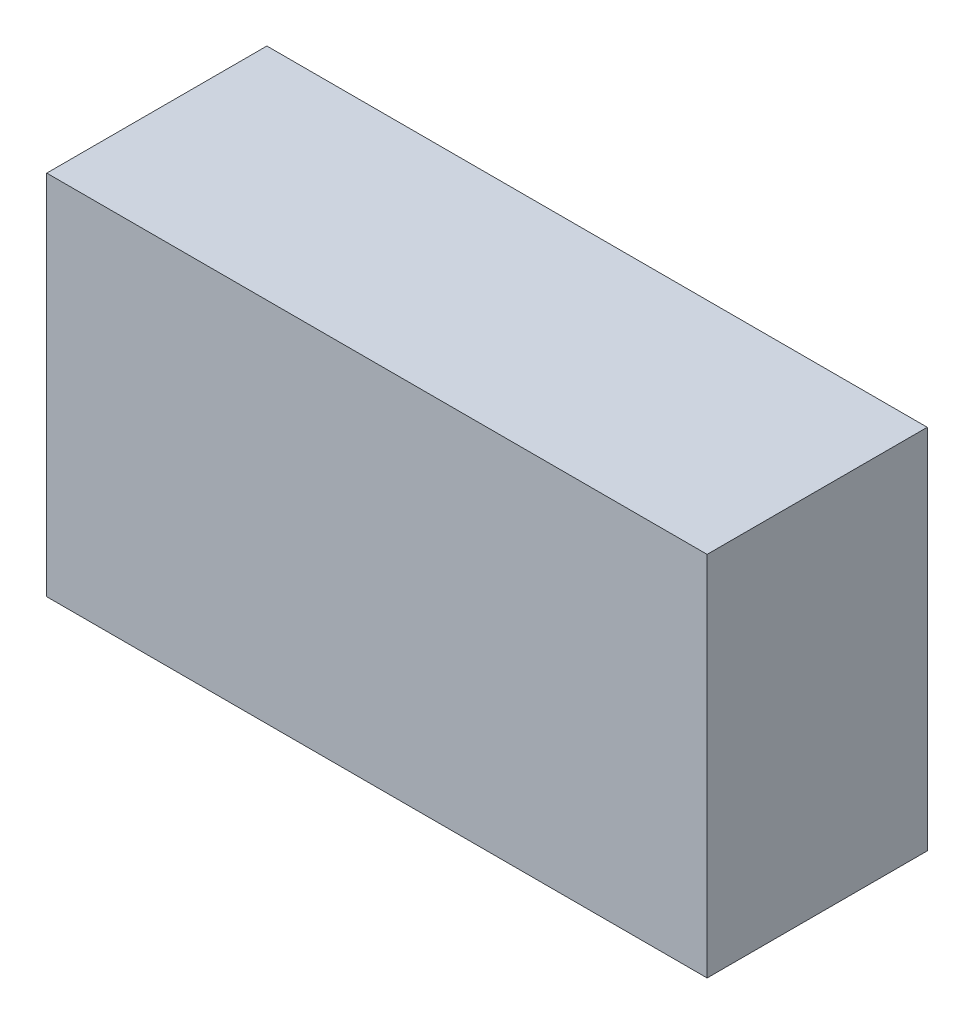
ISO-10303-21;
HEADER;
FILE_DESCRIPTION(('STEP AP214'),'2;1');
FILE_NAME('part.step','',(''),(''),'','','');
FILE_SCHEMA(('AUTOMOTIVE_DESIGN { 1 0 10303 214 1 1 1 1 }'));
ENDSEC;
DATA;
#1=APPLICATION_CONTEXT('core data for automotive mechanical design processes');
#2=APPLICATION_PROTOCOL_DEFINITION('international standard','automotive_design',2000,#1);
#3=PRODUCT_CONTEXT('',#1,'mechanical');
#4=PRODUCT('Part','Part','',(#3));
#5=PRODUCT_RELATED_PRODUCT_CATEGORY('part','',(#4));
#6=PRODUCT_DEFINITION_FORMATION('','',#4);
#7=PRODUCT_DEFINITION_CONTEXT('part definition',#1,'design');
#8=PRODUCT_DEFINITION('design','',#6,#7);
#9=PRODUCT_DEFINITION_SHAPE('','',#8);
#10=(LENGTH_UNIT() NAMED_UNIT(*) SI_UNIT(.MILLI.,.METRE.));
#11=(NAMED_UNIT(*) PLANE_ANGLE_UNIT() SI_UNIT($,.RADIAN.));
#12=(NAMED_UNIT(*) SI_UNIT($,.STERADIAN.) SOLID_ANGLE_UNIT());
#13=UNCERTAINTY_MEASURE_WITH_UNIT(LENGTH_MEASURE(1.E-05),#10,'distance_accuracy_value','');
#14=(GEOMETRIC_REPRESENTATION_CONTEXT(3) GLOBAL_UNCERTAINTY_ASSIGNED_CONTEXT((#13)) GLOBAL_UNIT_ASSIGNED_CONTEXT((#10,
#11,#12)) REPRESENTATION_CONTEXT('',''));
#15=CARTESIAN_POINT('',(0.,0.,0.));
#16=DIRECTION('',(0.,0.,1.));
#17=DIRECTION('',(1.,0.,0.));
#18=AXIS2_PLACEMENT_3D('',#15,#16,#17);
#19=CARTESIAN_POINT('',(0.,0.,0.3));
#20=DIRECTION('',(0.,0.,1.));
#21=DIRECTION('',(1.,0.,0.));
#22=AXIS2_PLACEMENT_3D('',#19,#20,#21);
#23=PLANE('',#22);
#24=DIRECTION('',(1.,0.,0.));
#25=VECTOR('',#24,1.);
#26=CARTESIAN_POINT('',(-0.45,-0.25,0.3));
#27=LINE('',#26,#25);
#28=CARTESIAN_POINT('',(0.45,-0.25,0.3));
#29=VERTEX_POINT('',#28);
#30=CARTESIAN_POINT('',(-0.45,-0.25,0.3));
#31=VERTEX_POINT('',#30);
#32=EDGE_CURVE('E58',#29,#31,#27,.F.);
#33=ORIENTED_EDGE('',*,*,#32,.F.);
#34=DIRECTION('',(0.,1.,0.));
#35=VECTOR('',#34,1.);
#36=CARTESIAN_POINT('',(0.45,-0.25,0.3));
#37=LINE('',#36,#35);
#38=CARTESIAN_POINT('',(0.45,0.25,0.3));
#39=VERTEX_POINT('',#38);
#40=EDGE_CURVE('E53',#39,#29,#37,.F.);
#41=ORIENTED_EDGE('',*,*,#40,.F.);
#42=DIRECTION('',(-1.,0.,0.));
#43=VECTOR('',#42,1.);
#44=CARTESIAN_POINT('',(0.45,0.25,0.3));
#45=LINE('',#44,#43);
#46=CARTESIAN_POINT('',(-0.45,0.25,0.3));
#47=VERTEX_POINT('',#46);
#48=EDGE_CURVE('E68',#47,#39,#45,.F.);
#49=ORIENTED_EDGE('',*,*,#48,.F.);
#50=DIRECTION('',(0.,1.,0.));
#51=VECTOR('',#50,1.);
#52=CARTESIAN_POINT('',(-0.45,0.25,0.3));
#53=LINE('',#52,#51);
#54=EDGE_CURVE('E20',#31,#47,#53,.T.);
#55=ORIENTED_EDGE('',*,*,#54,.F.);
#56=EDGE_LOOP('',(#33,#41,#49,#55));
#57=FACE_BOUND('',#56,.T.);
#58=ADVANCED_FACE('F17',(#57),#23,.T.);
#59=CARTESIAN_POINT('',(-0.45,0.25,0.));
#60=DIRECTION('',(-1.,0.,0.));
#61=DIRECTION('',(0.,0.,1.));
#62=AXIS2_PLACEMENT_3D('',#59,#60,#61);
#63=PLANE('',#62);
#64=ORIENTED_EDGE('',*,*,#54,.T.);
#65=DIRECTION('',(0.,0.,1.));
#66=VECTOR('',#65,1.);
#67=CARTESIAN_POINT('',(-0.45,0.25,0.));
#68=LINE('',#67,#66);
#69=CARTESIAN_POINT('',(-0.45,0.25,0.));
#70=VERTEX_POINT('',#69);
#71=EDGE_CURVE('E79',#70,#47,#68,.T.);
#72=ORIENTED_EDGE('',*,*,#71,.F.);
#73=DIRECTION('',(0.,1.,0.));
#74=VECTOR('',#73,1.);
#75=CARTESIAN_POINT('',(-0.45,0.,0.));
#76=LINE('',#75,#74);
#77=CARTESIAN_POINT('',(-0.45,-0.25,0.));
#78=VERTEX_POINT('',#77);
#79=EDGE_CURVE('E74',#70,#78,#76,.F.);
#80=ORIENTED_EDGE('',*,*,#79,.T.);
#81=DIRECTION('',(0.,0.,1.));
#82=VECTOR('',#81,1.);
#83=CARTESIAN_POINT('',(-0.45,-0.25,0.));
#84=LINE('',#83,#82);
#85=EDGE_CURVE('E63',#31,#78,#84,.F.);
#86=ORIENTED_EDGE('',*,*,#85,.F.);
#87=EDGE_LOOP('',(#64,#72,#80,#86));
#88=FACE_BOUND('',#87,.T.);
#89=ADVANCED_FACE('F73',(#88),#63,.T.);
#90=CARTESIAN_POINT('',(-0.45,-0.25,0.));
#91=DIRECTION('',(0.,-1.,0.));
#92=DIRECTION('',(1.,0.,0.));
#93=AXIS2_PLACEMENT_3D('',#90,#91,#92);
#94=PLANE('',#93);
#95=ORIENTED_EDGE('',*,*,#32,.T.);
#96=ORIENTED_EDGE('',*,*,#85,.T.);
#97=DIRECTION('',(1.,0.,0.));
#98=VECTOR('',#97,1.);
#99=CARTESIAN_POINT('',(0.,-0.25,0.));
#100=LINE('',#99,#98);
#101=CARTESIAN_POINT('',(0.45,-0.25,0.));
#102=VERTEX_POINT('',#101);
#103=EDGE_CURVE('E84',#78,#102,#100,.T.);
#104=ORIENTED_EDGE('',*,*,#103,.T.);
#105=DIRECTION('',(0.,0.,-1.));
#106=VECTOR('',#105,1.);
#107=CARTESIAN_POINT('',(0.45,-0.25,0.));
#108=LINE('',#107,#106);
#109=EDGE_CURVE('E65',#29,#102,#108,.T.);
#110=ORIENTED_EDGE('',*,*,#109,.F.);
#111=EDGE_LOOP('',(#95,#96,#104,#110));
#112=FACE_BOUND('',#111,.T.);
#113=ADVANCED_FACE('F60',(#112),#94,.T.);
#114=CARTESIAN_POINT('',(0.45,-0.25,0.));
#115=DIRECTION('',(1.,0.,0.));
#116=DIRECTION('',(0.,0.,-1.));
#117=AXIS2_PLACEMENT_3D('',#114,#115,#116);
#118=PLANE('',#117);
#119=ORIENTED_EDGE('',*,*,#40,.T.);
#120=ORIENTED_EDGE('',*,*,#109,.T.);
#121=DIRECTION('',(0.,1.,0.));
#122=VECTOR('',#121,1.);
#123=CARTESIAN_POINT('',(0.45,0.,0.));
#124=LINE('',#123,#122);
#125=CARTESIAN_POINT('',(0.45,0.25,0.));
#126=VERTEX_POINT('',#125);
#127=EDGE_CURVE('E26',#102,#126,#124,.T.);
#128=ORIENTED_EDGE('',*,*,#127,.T.);
#129=DIRECTION('',(0.,0.,1.));
#130=VECTOR('',#129,1.);
#131=CARTESIAN_POINT('',(0.45,0.25,0.));
#132=LINE('',#131,#130);
#133=EDGE_CURVE('E34',#39,#126,#132,.F.);
#134=ORIENTED_EDGE('',*,*,#133,.F.);
#135=EDGE_LOOP('',(#119,#120,#128,#134));
#136=FACE_BOUND('',#135,.T.);
#137=ADVANCED_FACE('F88',(#136),#118,.T.);
#138=CARTESIAN_POINT('',(0.45,0.25,0.));
#139=DIRECTION('',(0.,1.,0.));
#140=DIRECTION('',(-1.,0.,0.));
#141=AXIS2_PLACEMENT_3D('',#138,#139,#140);
#142=PLANE('',#141);
#143=ORIENTED_EDGE('',*,*,#48,.T.);
#144=ORIENTED_EDGE('',*,*,#133,.T.);
#145=DIRECTION('',(1.,0.,0.));
#146=VECTOR('',#145,1.);
#147=CARTESIAN_POINT('',(0.,0.25,0.));
#148=LINE('',#147,#146);
#149=EDGE_CURVE('E11',#126,#70,#148,.F.);
#150=ORIENTED_EDGE('',*,*,#149,.T.);
#151=ORIENTED_EDGE('',*,*,#71,.T.);
#152=EDGE_LOOP('',(#143,#144,#150,#151));
#153=FACE_BOUND('',#152,.T.);
#154=ADVANCED_FACE('F91',(#153),#142,.T.);
#155=CARTESIAN_POINT('',(0.,0.,0.));
#156=DIRECTION('',(0.,0.,1.));
#157=DIRECTION('',(1.,0.,0.));
#158=AXIS2_PLACEMENT_3D('',#155,#156,#157);
#159=PLANE('',#158);
#160=ORIENTED_EDGE('',*,*,#127,.F.);
#161=ORIENTED_EDGE('',*,*,#103,.F.);
#162=ORIENTED_EDGE('',*,*,#79,.F.);
#163=ORIENTED_EDGE('',*,*,#149,.F.);
#164=EDGE_LOOP('',(#160,#161,#162,#163));
#165=FACE_BOUND('',#164,.T.);
#166=ADVANCED_FACE('F90',(#165),#159,.F.);
#167=CLOSED_SHELL('',(#58,#89,#113,#137,#154,#166));
#168=MANIFOLD_SOLID_BREP('B1',#167);
#169=ADVANCED_BREP_SHAPE_REPRESENTATION('',(#18,#168),#14);
#170=SHAPE_DEFINITION_REPRESENTATION(#9,#169);
ENDSEC;
END-ISO-10303-21;
